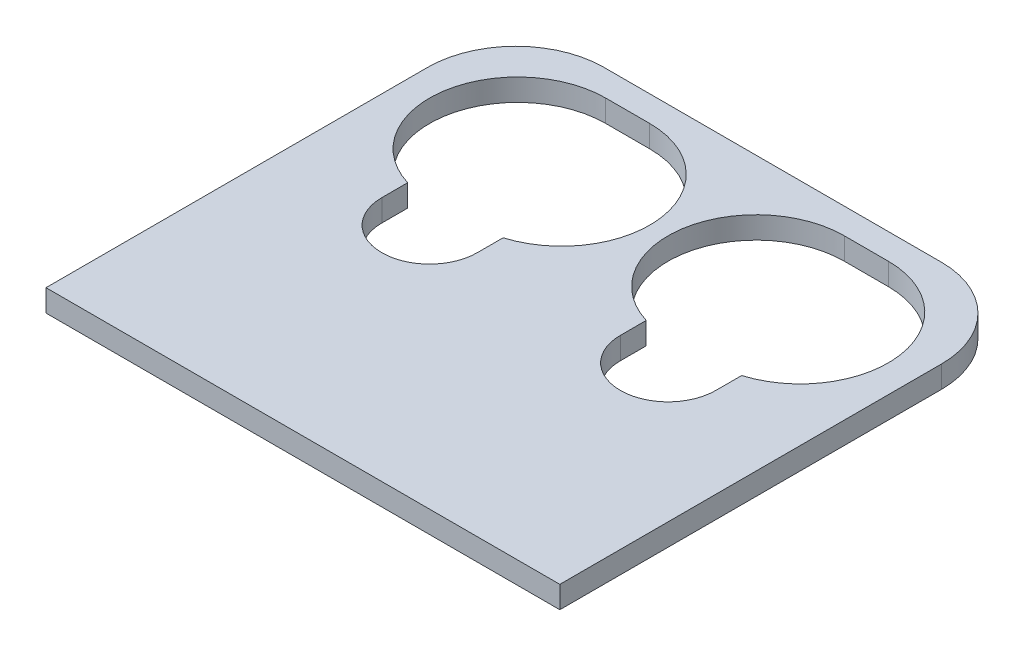
ISO-10303-21;
HEADER;
FILE_DESCRIPTION(('STEP AP214'),'2;1');
FILE_NAME('part.step','',(''),(''),'','','');
FILE_SCHEMA(('AUTOMOTIVE_DESIGN { 1 0 10303 214 1 1 1 1 }'));
ENDSEC;
DATA;
#1=APPLICATION_CONTEXT('core data for automotive mechanical design processes');
#2=APPLICATION_PROTOCOL_DEFINITION('international standard','automotive_design',2000,#1);
#3=PRODUCT_CONTEXT('',#1,'mechanical');
#4=PRODUCT('Part','Part','',(#3));
#5=PRODUCT_RELATED_PRODUCT_CATEGORY('part','',(#4));
#6=PRODUCT_DEFINITION_FORMATION('','',#4);
#7=PRODUCT_DEFINITION_CONTEXT('part definition',#1,'design');
#8=PRODUCT_DEFINITION('design','',#6,#7);
#9=PRODUCT_DEFINITION_SHAPE('','',#8);
#10=(LENGTH_UNIT() NAMED_UNIT(*) SI_UNIT(.MILLI.,.METRE.));
#11=(NAMED_UNIT(*) PLANE_ANGLE_UNIT() SI_UNIT($,.RADIAN.));
#12=(NAMED_UNIT(*) SI_UNIT($,.STERADIAN.) SOLID_ANGLE_UNIT());
#13=UNCERTAINTY_MEASURE_WITH_UNIT(LENGTH_MEASURE(1.E-05),#10,'distance_accuracy_value','');
#14=(GEOMETRIC_REPRESENTATION_CONTEXT(3) GLOBAL_UNCERTAINTY_ASSIGNED_CONTEXT((#13)) GLOBAL_UNIT_ASSIGNED_CONTEXT((#10,
#11,#12)) REPRESENTATION_CONTEXT('',''));
#15=CARTESIAN_POINT('',(0.,0.,0.));
#16=DIRECTION('',(0.,0.,1.));
#17=DIRECTION('',(1.,0.,0.));
#18=AXIS2_PLACEMENT_3D('',#15,#16,#17);
#19=CARTESIAN_POINT('',(0.,3.,0.));
#20=DIRECTION('',(0.,-1.,0.));
#21=DIRECTION('',(0.,0.,-1.));
#22=AXIS2_PLACEMENT_3D('',#19,#20,#21);
#23=PLANE('',#22);
#24=DIRECTION('',(0.,0.,-1.));
#25=VECTOR('',#24,1.);
#26=CARTESIAN_POINT('',(35.,3.,33.5));
#27=LINE('',#26,#25);
#28=CARTESIAN_POINT('',(35.,3.,33.5));
#29=VERTEX_POINT('',#28);
#30=CARTESIAN_POINT('',(35.,3.,-18.5));
#31=VERTEX_POINT('',#30);
#32=EDGE_CURVE('E281',#29,#31,#27,.T.);
#33=ORIENTED_EDGE('',*,*,#32,.T.);
#34=CARTESIAN_POINT('',(23.,3.,-18.5));
#35=DIRECTION('',(0.,-1.,0.));
#36=DIRECTION('',(0.,0.,-1.));
#37=AXIS2_PLACEMENT_3D('',#34,#35,#36);
#38=CIRCLE('',#37,12.);
#39=CARTESIAN_POINT('',(23.,3.,-30.5));
#40=VERTEX_POINT('',#39);
#41=EDGE_CURVE('E305',#31,#40,#38,.F.);
#42=ORIENTED_EDGE('',*,*,#41,.T.);
#43=DIRECTION('',(-1.,0.,0.));
#44=VECTOR('',#43,1.);
#45=CARTESIAN_POINT('',(0.,3.,-30.5));
#46=LINE('',#45,#44);
#47=CARTESIAN_POINT('',(-23.,3.,-30.5));
#48=VERTEX_POINT('',#47);
#49=EDGE_CURVE('E277',#40,#48,#46,.T.);
#50=ORIENTED_EDGE('',*,*,#49,.T.);
#51=CARTESIAN_POINT('',(-23.,3.,-18.5));
#52=DIRECTION('',(0.,-1.,0.));
#53=DIRECTION('',(0.,0.,-1.));
#54=AXIS2_PLACEMENT_3D('',#51,#52,#53);
#55=CIRCLE('',#54,12.);
#56=CARTESIAN_POINT('',(-35.,3.,-18.5));
#57=VERTEX_POINT('',#56);
#58=EDGE_CURVE('E303',#48,#57,#55,.F.);
#59=ORIENTED_EDGE('',*,*,#58,.T.);
#60=DIRECTION('',(0.,0.,1.));
#61=VECTOR('',#60,1.);
#62=CARTESIAN_POINT('',(-35.,3.,33.5));
#63=LINE('',#62,#61);
#64=CARTESIAN_POINT('',(-35.,3.,33.5));
#65=VERTEX_POINT('',#64);
#66=EDGE_CURVE('E284',#57,#65,#63,.T.);
#67=ORIENTED_EDGE('',*,*,#66,.T.);
#68=DIRECTION('',(1.,0.,0.));
#69=VECTOR('',#68,1.);
#70=CARTESIAN_POINT('',(-35.,3.,33.5));
#71=LINE('',#70,#69);
#72=EDGE_CURVE('E287',#65,#29,#71,.T.);
#73=ORIENTED_EDGE('',*,*,#72,.T.);
#74=EDGE_LOOP('',(#33,#42,#50,#59,#67,#73));
#75=FACE_BOUND('',#74,.T.);
#76=CARTESIAN_POINT('',(-16.25,3.,0.));
#77=DIRECTION('',(0.,-1.,0.));
#78=DIRECTION('',(0.,0.,-1.));
#79=AXIS2_PLACEMENT_3D('',#76,#77,#78);
#80=CIRCLE('',#79,6.5);
#81=CARTESIAN_POINT('',(-9.75,3.,0.));
#82=VERTEX_POINT('',#81);
#83=CARTESIAN_POINT('',(-22.75,3.,0.));
#84=VERTEX_POINT('',#83);
#85=EDGE_CURVE('E270',#82,#84,#80,.T.);
#86=ORIENTED_EDGE('',*,*,#85,.T.);
#87=DIRECTION('',(0.,0.,-1.));
#88=VECTOR('',#87,1.);
#89=CARTESIAN_POINT('',(-22.75,3.,0.));
#90=LINE('',#89,#88);
#91=CARTESIAN_POINT('',(-22.75,3.,-3.521759716751));
#92=VERTEX_POINT('',#91);
#93=EDGE_CURVE('E242',#84,#92,#90,.T.);
#94=ORIENTED_EDGE('',*,*,#93,.T.);
#95=CARTESIAN_POINT('',(-19.25,3.,-15.));
#96=DIRECTION('',(0.,-1.,0.));
#97=DIRECTION('',(0.,0.,-1.));
#98=AXIS2_PLACEMENT_3D('',#95,#96,#97);
#99=CIRCLE('',#98,12.);
#100=CARTESIAN_POINT('',(-19.25,3.000006,-27.));
#101=VERTEX_POINT('',#100);
#102=EDGE_CURVE('E323',#92,#101,#99,.T.);
#103=ORIENTED_EDGE('',*,*,#102,.T.);
#104=DIRECTION('',(1.,0.,0.));
#105=VECTOR('',#104,1.);
#106=CARTESIAN_POINT('',(0.,3.,-27.));
#107=LINE('',#106,#105);
#108=CARTESIAN_POINT('',(-13.25,3.000006,-27.));
#109=VERTEX_POINT('',#108);
#110=EDGE_CURVE('E271',#101,#109,#107,.T.);
#111=ORIENTED_EDGE('',*,*,#110,.T.);
#112=CARTESIAN_POINT('',(-13.25,3.,-15.));
#113=DIRECTION('',(0.,-1.,0.));
#114=DIRECTION('',(0.,0.,-1.));
#115=AXIS2_PLACEMENT_3D('',#112,#113,#114);
#116=CIRCLE('',#115,12.);
#117=CARTESIAN_POINT('',(-9.75,3.,-3.521759716751));
#118=VERTEX_POINT('',#117);
#119=EDGE_CURVE('E263',#109,#118,#116,.T.);
#120=ORIENTED_EDGE('',*,*,#119,.T.);
#121=DIRECTION('',(0.,0.,1.));
#122=VECTOR('',#121,1.);
#123=CARTESIAN_POINT('',(-9.75,3.,0.));
#124=LINE('',#123,#122);
#125=EDGE_CURVE('E237',#118,#82,#124,.T.);
#126=ORIENTED_EDGE('',*,*,#125,.T.);
#127=EDGE_LOOP('',(#86,#94,#103,#111,#120,#126));
#128=FACE_BOUND('',#127,.T.);
#129=DIRECTION('',(0.,0.,-1.));
#130=VECTOR('',#129,1.);
#131=CARTESIAN_POINT('',(22.75,3.,0.));
#132=LINE('',#131,#130);
#133=CARTESIAN_POINT('',(22.75,3.,0.));
#134=VERTEX_POINT('',#133);
#135=CARTESIAN_POINT('',(22.75,3.,-3.521759716751));
#136=VERTEX_POINT('',#135);
#137=EDGE_CURVE('E48',#134,#136,#132,.T.);
#138=ORIENTED_EDGE('',*,*,#137,.F.);
#139=CARTESIAN_POINT('',(16.25,3.,0.));
#140=DIRECTION('',(0.,-1.,0.));
#141=DIRECTION('',(0.,0.,-1.));
#142=AXIS2_PLACEMENT_3D('',#139,#140,#141);
#143=CIRCLE('',#142,6.5);
#144=CARTESIAN_POINT('',(9.75,3.,0.));
#145=VERTEX_POINT('',#144);
#146=EDGE_CURVE('E177',#145,#134,#143,.F.);
#147=ORIENTED_EDGE('',*,*,#146,.F.);
#148=DIRECTION('',(0.,0.,1.));
#149=VECTOR('',#148,1.);
#150=CARTESIAN_POINT('',(9.75,3.,0.));
#151=LINE('',#150,#149);
#152=CARTESIAN_POINT('',(9.75,3.,-3.521759716751));
#153=VERTEX_POINT('',#152);
#154=EDGE_CURVE('E158',#153,#145,#151,.T.);
#155=ORIENTED_EDGE('',*,*,#154,.F.);
#156=CARTESIAN_POINT('',(13.25,3.,-15.));
#157=DIRECTION('',(0.,-1.,0.));
#158=DIRECTION('',(0.,0.,-1.));
#159=AXIS2_PLACEMENT_3D('',#156,#157,#158);
#160=CIRCLE('',#159,12.);
#161=CARTESIAN_POINT('',(13.25,3.,-27.));
#162=VERTEX_POINT('',#161);
#163=EDGE_CURVE('E197',#162,#153,#160,.F.);
#164=ORIENTED_EDGE('',*,*,#163,.F.);
#165=DIRECTION('',(-1.,0.,0.));
#166=VECTOR('',#165,1.);
#167=CARTESIAN_POINT('',(0.,3.,-27.));
#168=LINE('',#167,#166);
#169=CARTESIAN_POINT('',(19.25,3.,-27.));
#170=VERTEX_POINT('',#169);
#171=EDGE_CURVE('E178',#170,#162,#168,.T.);
#172=ORIENTED_EDGE('',*,*,#171,.F.);
#173=CARTESIAN_POINT('',(19.25,3.,-15.));
#174=DIRECTION('',(0.,-1.,0.));
#175=DIRECTION('',(0.,0.,-1.));
#176=AXIS2_PLACEMENT_3D('',#173,#174,#175);
#177=CIRCLE('',#176,12.);
#178=EDGE_CURVE('E182',#136,#170,#177,.F.);
#179=ORIENTED_EDGE('',*,*,#178,.F.);
#180=EDGE_LOOP('',(#138,#147,#155,#164,#172,#179));
#181=FACE_BOUND('',#180,.T.);
#182=ADVANCED_FACE('F33',(#75,#128,#181),#23,.F.);
#183=CARTESIAN_POINT('',(0.,0.,0.));
#184=DIRECTION('',(0.,-1.,0.));
#185=DIRECTION('',(0.,0.,-1.));
#186=AXIS2_PLACEMENT_3D('',#183,#184,#185);
#187=PLANE('',#186);
#188=DIRECTION('',(0.,0.,-1.));
#189=VECTOR('',#188,1.);
#190=CARTESIAN_POINT('',(-22.75,0.,0.));
#191=LINE('',#190,#189);
#192=CARTESIAN_POINT('',(-22.75,0.,0.));
#193=VERTEX_POINT('',#192);
#194=CARTESIAN_POINT('',(-22.75,0.,-3.521759716751));
#195=VERTEX_POINT('',#194);
#196=EDGE_CURVE('E240',#193,#195,#191,.T.);
#197=ORIENTED_EDGE('',*,*,#196,.F.);
#198=CARTESIAN_POINT('',(-16.25,0.,0.));
#199=DIRECTION('',(0.,1.,0.));
#200=DIRECTION('',(0.,0.,1.));
#201=AXIS2_PLACEMENT_3D('',#198,#199,#200);
#202=CIRCLE('',#201,6.5);
#203=CARTESIAN_POINT('',(-9.75,0.,0.));
#204=VERTEX_POINT('',#203);
#205=EDGE_CURVE('E267',#193,#204,#202,.T.);
#206=ORIENTED_EDGE('',*,*,#205,.T.);
#207=DIRECTION('',(0.,0.,1.));
#208=VECTOR('',#207,1.);
#209=CARTESIAN_POINT('',(-9.75,0.,0.));
#210=LINE('',#209,#208);
#211=CARTESIAN_POINT('',(-9.75,0.,-3.521759716751));
#212=VERTEX_POINT('',#211);
#213=EDGE_CURVE('E233',#212,#204,#210,.T.);
#214=ORIENTED_EDGE('',*,*,#213,.F.);
#215=CARTESIAN_POINT('',(-13.25,0.,-15.));
#216=DIRECTION('',(0.,1.,0.));
#217=DIRECTION('',(0.,0.,1.));
#218=AXIS2_PLACEMENT_3D('',#215,#216,#217);
#219=CIRCLE('',#218,12.);
#220=CARTESIAN_POINT('',(-13.25,0.,-27.));
#221=VERTEX_POINT('',#220);
#222=EDGE_CURVE('E248',#212,#221,#219,.T.);
#223=ORIENTED_EDGE('',*,*,#222,.T.);
#224=DIRECTION('',(-1.,0.,0.));
#225=VECTOR('',#224,1.);
#226=CARTESIAN_POINT('',(-19.25,0.,-27.));
#227=LINE('',#226,#225);
#228=CARTESIAN_POINT('',(-19.25,0.,-27.));
#229=VERTEX_POINT('',#228);
#230=EDGE_CURVE('E250',#221,#229,#227,.T.);
#231=ORIENTED_EDGE('',*,*,#230,.T.);
#232=CARTESIAN_POINT('',(-19.25,0.,-15.));
#233=DIRECTION('',(0.,1.,0.));
#234=DIRECTION('',(0.,0.,1.));
#235=AXIS2_PLACEMENT_3D('',#232,#233,#234);
#236=CIRCLE('',#235,12.);
#237=EDGE_CURVE('E245',#229,#195,#236,.T.);
#238=ORIENTED_EDGE('',*,*,#237,.T.);
#239=EDGE_LOOP('',(#197,#206,#214,#223,#231,#238));
#240=FACE_BOUND('',#239,.T.);
#241=DIRECTION('',(1.,0.,0.));
#242=VECTOR('',#241,1.);
#243=CARTESIAN_POINT('',(-35.,0.,-30.5));
#244=LINE('',#243,#242);
#245=CARTESIAN_POINT('',(-23.,0.,-30.5));
#246=VERTEX_POINT('',#245);
#247=CARTESIAN_POINT('',(23.,0.,-30.5));
#248=VERTEX_POINT('',#247);
#249=EDGE_CURVE('E274',#246,#248,#244,.T.);
#250=ORIENTED_EDGE('',*,*,#249,.T.);
#251=CARTESIAN_POINT('',(23.,0.,-18.5));
#252=DIRECTION('',(0.,-1.,0.));
#253=DIRECTION('',(0.,0.,-1.));
#254=AXIS2_PLACEMENT_3D('',#251,#252,#253);
#255=CIRCLE('',#254,12.);
#256=CARTESIAN_POINT('',(35.,0.,-18.5));
#257=VERTEX_POINT('',#256);
#258=EDGE_CURVE('E314',#248,#257,#255,.T.);
#259=ORIENTED_EDGE('',*,*,#258,.T.);
#260=DIRECTION('',(0.,0.,-1.));
#261=VECTOR('',#260,1.);
#262=CARTESIAN_POINT('',(35.,0.,33.5));
#263=LINE('',#262,#261);
#264=CARTESIAN_POINT('',(35.,0.,33.5));
#265=VERTEX_POINT('',#264);
#266=EDGE_CURVE('E280',#265,#257,#263,.T.);
#267=ORIENTED_EDGE('',*,*,#266,.F.);
#268=DIRECTION('',(1.,0.,0.));
#269=VECTOR('',#268,1.);
#270=CARTESIAN_POINT('',(-35.,0.,33.5));
#271=LINE('',#270,#269);
#272=CARTESIAN_POINT('',(-35.,0.,33.5));
#273=VERTEX_POINT('',#272);
#274=EDGE_CURVE('E285',#273,#265,#271,.T.);
#275=ORIENTED_EDGE('',*,*,#274,.F.);
#276=DIRECTION('',(0.,0.,1.));
#277=VECTOR('',#276,1.);
#278=CARTESIAN_POINT('',(-35.,0.,33.5));
#279=LINE('',#278,#277);
#280=CARTESIAN_POINT('',(-35.,0.,-18.5));
#281=VERTEX_POINT('',#280);
#282=EDGE_CURVE('E292',#281,#273,#279,.T.);
#283=ORIENTED_EDGE('',*,*,#282,.F.);
#284=CARTESIAN_POINT('',(-23.,0.,-18.5));
#285=DIRECTION('',(0.,-1.,0.));
#286=DIRECTION('',(0.,0.,-1.));
#287=AXIS2_PLACEMENT_3D('',#284,#285,#286);
#288=CIRCLE('',#287,12.);
#289=EDGE_CURVE('E312',#281,#246,#288,.T.);
#290=ORIENTED_EDGE('',*,*,#289,.T.);
#291=EDGE_LOOP('',(#250,#259,#267,#275,#283,#290));
#292=FACE_BOUND('',#291,.T.);
#293=CARTESIAN_POINT('',(16.25,0.,0.));
#294=DIRECTION('',(0.,-1.,0.));
#295=DIRECTION('',(0.,0.,-1.));
#296=AXIS2_PLACEMENT_3D('',#293,#294,#295);
#297=CIRCLE('',#296,6.5);
#298=CARTESIAN_POINT('',(9.75,0.,0.));
#299=VERTEX_POINT('',#298);
#300=CARTESIAN_POINT('',(22.75,0.,0.));
#301=VERTEX_POINT('',#300);
#302=EDGE_CURVE('E170',#299,#301,#297,.F.);
#303=ORIENTED_EDGE('',*,*,#302,.T.);
#304=DIRECTION('',(0.,0.,-1.));
#305=VECTOR('',#304,1.);
#306=CARTESIAN_POINT('',(22.75,0.,0.));
#307=LINE('',#306,#305);
#308=CARTESIAN_POINT('',(22.75,0.,-3.521759716751));
#309=VERTEX_POINT('',#308);
#310=EDGE_CURVE('E217',#301,#309,#307,.T.);
#311=ORIENTED_EDGE('',*,*,#310,.T.);
#312=CARTESIAN_POINT('',(19.25,0.,-15.));
#313=DIRECTION('',(0.,-1.,0.));
#314=DIRECTION('',(0.,0.,-1.));
#315=AXIS2_PLACEMENT_3D('',#312,#313,#314);
#316=CIRCLE('',#315,12.);
#317=CARTESIAN_POINT('',(19.25,-2.5E-06,-27.));
#318=VERTEX_POINT('',#317);
#319=EDGE_CURVE('E196',#309,#318,#316,.F.);
#320=ORIENTED_EDGE('',*,*,#319,.T.);
#321=DIRECTION('',(-1.,0.,0.));
#322=VECTOR('',#321,1.);
#323=CARTESIAN_POINT('',(0.,0.,-27.));
#324=LINE('',#323,#322);
#325=CARTESIAN_POINT('',(13.25,-2.5E-06,-27.));
#326=VERTEX_POINT('',#325);
#327=EDGE_CURVE('E193',#318,#326,#324,.T.);
#328=ORIENTED_EDGE('',*,*,#327,.T.);
#329=CARTESIAN_POINT('',(13.25,0.,-15.));
#330=DIRECTION('',(0.,-1.,0.));
#331=DIRECTION('',(0.,0.,-1.));
#332=AXIS2_PLACEMENT_3D('',#329,#330,#331);
#333=CIRCLE('',#332,12.);
#334=CARTESIAN_POINT('',(9.75,0.,-3.521759716751));
#335=VERTEX_POINT('',#334);
#336=EDGE_CURVE('E173',#326,#335,#333,.F.);
#337=ORIENTED_EDGE('',*,*,#336,.T.);
#338=DIRECTION('',(0.,0.,1.));
#339=VECTOR('',#338,1.);
#340=CARTESIAN_POINT('',(9.75,0.,0.));
#341=LINE('',#340,#339);
#342=EDGE_CURVE('E55',#335,#299,#341,.T.);
#343=ORIENTED_EDGE('',*,*,#342,.T.);
#344=EDGE_LOOP('',(#303,#311,#320,#328,#337,#343));
#345=FACE_BOUND('',#344,.T.);
#346=ADVANCED_FACE('F168',(#240,#292,#345),#187,.T.);
#347=CARTESIAN_POINT('',(16.25,-2.49999999998515E-05,0.));
#348=DIRECTION('',(0.,1.,0.));
#349=DIRECTION('',(0.,0.,1.));
#350=AXIS2_PLACEMENT_3D('',#347,#348,#349);
#351=CYLINDRICAL_SURFACE('',#350,6.5);
#352=ORIENTED_EDGE('',*,*,#146,.T.);
#353=DIRECTION('',(0.,1.,0.));
#354=VECTOR('',#353,1.);
#355=CARTESIAN_POINT('',(22.75,-0.000139999999999169,0.));
#356=LINE('',#355,#354);
#357=EDGE_CURVE('E163',#301,#134,#356,.T.);
#358=ORIENTED_EDGE('',*,*,#357,.F.);
#359=ORIENTED_EDGE('',*,*,#302,.F.);
#360=DIRECTION('',(0.,1.,0.));
#361=VECTOR('',#360,1.);
#362=CARTESIAN_POINT('',(9.75,-0.000139999999999169,0.));
#363=LINE('',#362,#361);
#364=EDGE_CURVE('E155',#299,#145,#363,.T.);
#365=ORIENTED_EDGE('',*,*,#364,.T.);
#366=EDGE_LOOP('',(#352,#358,#359,#365));
#367=FACE_BOUND('',#366,.T.);
#368=ADVANCED_FACE('F176',(#367),#351,.F.);
#369=CARTESIAN_POINT('',(19.25,-2.49999999998515E-05,-15.));
#370=DIRECTION('',(0.,1.,0.));
#371=DIRECTION('',(0.,0.,1.));
#372=AXIS2_PLACEMENT_3D('',#369,#370,#371);
#373=CYLINDRICAL_SURFACE('',#372,12.);
#374=ORIENTED_EDGE('',*,*,#319,.F.);
#375=DIRECTION('',(0.,1.,0.));
#376=VECTOR('',#375,1.);
#377=CARTESIAN_POINT('',(22.75,-2.49999999998515E-05,-3.521759716751));
#378=LINE('',#377,#376);
#379=EDGE_CURVE('E11',#309,#136,#378,.T.);
#380=ORIENTED_EDGE('',*,*,#379,.T.);
#381=ORIENTED_EDGE('',*,*,#178,.T.);
#382=DIRECTION('',(0.,1.,0.));
#383=VECTOR('',#382,1.);
#384=CARTESIAN_POINT('',(19.25,-2.49999999998515E-05,-27.));
#385=LINE('',#384,#383);
#386=EDGE_CURVE('E212',#318,#170,#385,.T.);
#387=ORIENTED_EDGE('',*,*,#386,.F.);
#388=EDGE_LOOP('',(#374,#380,#381,#387));
#389=FACE_BOUND('',#388,.T.);
#390=ADVANCED_FACE('F226',(#389),#373,.F.);
#391=CARTESIAN_POINT('',(13.25,-2.49999999998515E-05,-15.));
#392=DIRECTION('',(0.,1.,0.));
#393=DIRECTION('',(0.,0.,1.));
#394=AXIS2_PLACEMENT_3D('',#391,#392,#393);
#395=CYLINDRICAL_SURFACE('',#394,12.);
#396=ORIENTED_EDGE('',*,*,#163,.T.);
#397=DIRECTION('',(0.,1.,0.));
#398=VECTOR('',#397,1.);
#399=CARTESIAN_POINT('',(9.75,-2.49999999998515E-05,-3.521759716751));
#400=LINE('',#399,#398);
#401=EDGE_CURVE('E41',#153,#335,#400,.F.);
#402=ORIENTED_EDGE('',*,*,#401,.T.);
#403=ORIENTED_EDGE('',*,*,#336,.F.);
#404=DIRECTION('',(0.,1.,0.));
#405=VECTOR('',#404,1.);
#406=CARTESIAN_POINT('',(13.25,-2.49999999998515E-05,-27.));
#407=LINE('',#406,#405);
#408=EDGE_CURVE('E206',#326,#162,#407,.T.);
#409=ORIENTED_EDGE('',*,*,#408,.T.);
#410=EDGE_LOOP('',(#396,#402,#403,#409));
#411=FACE_BOUND('',#410,.T.);
#412=ADVANCED_FACE('F385',(#411),#395,.F.);
#413=CARTESIAN_POINT('',(35.,3.,33.5));
#414=DIRECTION('',(-1.,0.,0.));
#415=DIRECTION('',(0.,0.,1.));
#416=AXIS2_PLACEMENT_3D('',#413,#414,#415);
#417=PLANE('',#416);
#418=ORIENTED_EDGE('',*,*,#266,.T.);
#419=DIRECTION('',(0.,1.,0.));
#420=VECTOR('',#419,1.);
#421=CARTESIAN_POINT('',(35.,3.,-18.5));
#422=LINE('',#421,#420);
#423=EDGE_CURVE('E300',#257,#31,#422,.T.);
#424=ORIENTED_EDGE('',*,*,#423,.T.);
#425=ORIENTED_EDGE('',*,*,#32,.F.);
#426=DIRECTION('',(0.,-1.,0.));
#427=VECTOR('',#426,1.);
#428=CARTESIAN_POINT('',(35.,3.,33.5));
#429=LINE('',#428,#427);
#430=EDGE_CURVE('E289',#29,#265,#429,.T.);
#431=ORIENTED_EDGE('',*,*,#430,.T.);
#432=EDGE_LOOP('',(#418,#424,#425,#431));
#433=FACE_BOUND('',#432,.T.);
#434=ADVANCED_FACE('F382',(#433),#417,.F.);
#435=CARTESIAN_POINT('',(-35.,3.,33.5));
#436=DIRECTION('',(1.,0.,0.));
#437=DIRECTION('',(0.,0.,-1.));
#438=AXIS2_PLACEMENT_3D('',#435,#436,#437);
#439=PLANE('',#438);
#440=ORIENTED_EDGE('',*,*,#66,.F.);
#441=DIRECTION('',(0.,1.,0.));
#442=VECTOR('',#441,1.);
#443=CARTESIAN_POINT('',(-35.,3.,-18.5));
#444=LINE('',#443,#442);
#445=EDGE_CURVE('E316',#57,#281,#444,.F.);
#446=ORIENTED_EDGE('',*,*,#445,.T.);
#447=ORIENTED_EDGE('',*,*,#282,.T.);
#448=DIRECTION('',(0.,-1.,0.));
#449=VECTOR('',#448,1.);
#450=CARTESIAN_POINT('',(-35.,3.,33.5));
#451=LINE('',#450,#449);
#452=EDGE_CURVE('E297',#65,#273,#451,.T.);
#453=ORIENTED_EDGE('',*,*,#452,.F.);
#454=EDGE_LOOP('',(#440,#446,#447,#453));
#455=FACE_BOUND('',#454,.T.);
#456=ADVANCED_FACE('F378',(#455),#439,.F.);
#457=CARTESIAN_POINT('',(-35.,3.,33.5));
#458=DIRECTION('',(0.,0.,-1.));
#459=DIRECTION('',(-1.,0.,0.));
#460=AXIS2_PLACEMENT_3D('',#457,#458,#459);
#461=PLANE('',#460);
#462=ORIENTED_EDGE('',*,*,#274,.T.);
#463=ORIENTED_EDGE('',*,*,#430,.F.);
#464=ORIENTED_EDGE('',*,*,#72,.F.);
#465=ORIENTED_EDGE('',*,*,#452,.T.);
#466=EDGE_LOOP('',(#462,#463,#464,#465));
#467=FACE_BOUND('',#466,.T.);
#468=ADVANCED_FACE('F375',(#467),#461,.F.);
#469=CARTESIAN_POINT('',(-35.,0.,-30.5));
#470=DIRECTION('',(0.,0.,1.));
#471=DIRECTION('',(1.,0.,0.));
#472=AXIS2_PLACEMENT_3D('',#469,#470,#471);
#473=PLANE('',#472);
#474=ORIENTED_EDGE('',*,*,#49,.F.);
#475=DIRECTION('',(0.,1.,0.));
#476=VECTOR('',#475,1.);
#477=CARTESIAN_POINT('',(23.,0.,-30.5));
#478=LINE('',#477,#476);
#479=EDGE_CURVE('E310',#40,#248,#478,.F.);
#480=ORIENTED_EDGE('',*,*,#479,.T.);
#481=ORIENTED_EDGE('',*,*,#249,.F.);
#482=DIRECTION('',(0.,1.,0.));
#483=VECTOR('',#482,1.);
#484=CARTESIAN_POINT('',(-23.,0.,-30.5));
#485=LINE('',#484,#483);
#486=EDGE_CURVE('E307',#246,#48,#485,.T.);
#487=ORIENTED_EDGE('',*,*,#486,.T.);
#488=EDGE_LOOP('',(#474,#480,#481,#487));
#489=FACE_BOUND('',#488,.T.);
#490=ADVANCED_FACE('F372',(#489),#473,.F.);
#491=CARTESIAN_POINT('',(23.,3.,-18.5));
#492=DIRECTION('',(0.,1.,0.));
#493=DIRECTION('',(0.,0.,1.));
#494=AXIS2_PLACEMENT_3D('',#491,#492,#493);
#495=CYLINDRICAL_SURFACE('',#494,12.);
#496=ORIENTED_EDGE('',*,*,#258,.F.);
#497=ORIENTED_EDGE('',*,*,#479,.F.);
#498=ORIENTED_EDGE('',*,*,#41,.F.);
#499=ORIENTED_EDGE('',*,*,#423,.F.);
#500=EDGE_LOOP('',(#496,#497,#498,#499));
#501=FACE_BOUND('',#500,.T.);
#502=ADVANCED_FACE('F387',(#501),#495,.T.);
#503=CARTESIAN_POINT('',(-23.,0.,-18.5));
#504=DIRECTION('',(0.,1.,0.));
#505=DIRECTION('',(0.,0.,1.));
#506=AXIS2_PLACEMENT_3D('',#503,#504,#505);
#507=CYLINDRICAL_SURFACE('',#506,12.);
#508=ORIENTED_EDGE('',*,*,#289,.F.);
#509=ORIENTED_EDGE('',*,*,#445,.F.);
#510=ORIENTED_EDGE('',*,*,#58,.F.);
#511=ORIENTED_EDGE('',*,*,#486,.F.);
#512=EDGE_LOOP('',(#508,#509,#510,#511));
#513=FACE_BOUND('',#512,.T.);
#514=ADVANCED_FACE('F35',(#513),#507,.T.);
#515=CARTESIAN_POINT('',(-16.25,0.,0.));
#516=DIRECTION('',(0.,1.,0.));
#517=DIRECTION('',(0.,0.,1.));
#518=AXIS2_PLACEMENT_3D('',#515,#516,#517);
#519=CYLINDRICAL_SURFACE('',#518,6.5);
#520=ORIENTED_EDGE('',*,*,#85,.F.);
#521=DIRECTION('',(0.,1.,0.));
#522=VECTOR('',#521,1.);
#523=CARTESIAN_POINT('',(-9.75,-2.49999999998515E-05,0.));
#524=LINE('',#523,#522);
#525=EDGE_CURVE('E231',#204,#82,#524,.T.);
#526=ORIENTED_EDGE('',*,*,#525,.F.);
#527=ORIENTED_EDGE('',*,*,#205,.F.);
#528=DIRECTION('',(0.,1.,0.));
#529=VECTOR('',#528,1.);
#530=CARTESIAN_POINT('',(-22.75,-2.49999999998515E-05,0.));
#531=LINE('',#530,#529);
#532=EDGE_CURVE('E180',#193,#84,#531,.T.);
#533=ORIENTED_EDGE('',*,*,#532,.T.);
#534=EDGE_LOOP('',(#520,#526,#527,#533));
#535=FACE_BOUND('',#534,.T.);
#536=ADVANCED_FACE('F352',(#535),#519,.F.);
#537=CARTESIAN_POINT('',(-19.25,0.,-27.));
#538=DIRECTION('',(0.,0.,-1.));
#539=DIRECTION('',(-1.,0.,0.));
#540=AXIS2_PLACEMENT_3D('',#537,#538,#539);
#541=PLANE('',#540);
#542=DIRECTION('',(0.,1.,0.));
#543=VECTOR('',#542,1.);
#544=CARTESIAN_POINT('',(-19.25,0.,-27.));
#545=LINE('',#544,#543);
#546=EDGE_CURVE('E262',#229,#101,#545,.T.);
#547=ORIENTED_EDGE('',*,*,#546,.F.);
#548=ORIENTED_EDGE('',*,*,#230,.F.);
#549=DIRECTION('',(0.,1.,0.));
#550=VECTOR('',#549,1.);
#551=CARTESIAN_POINT('',(-13.25,0.,-27.));
#552=LINE('',#551,#550);
#553=EDGE_CURVE('E253',#221,#109,#552,.T.);
#554=ORIENTED_EDGE('',*,*,#553,.T.);
#555=ORIENTED_EDGE('',*,*,#110,.F.);
#556=EDGE_LOOP('',(#547,#548,#554,#555));
#557=FACE_BOUND('',#556,.T.);
#558=ADVANCED_FACE('F346',(#557),#541,.F.);
#559=CARTESIAN_POINT('',(-19.25,0.,-15.));
#560=DIRECTION('',(0.,1.,0.));
#561=DIRECTION('',(0.,0.,1.));
#562=AXIS2_PLACEMENT_3D('',#559,#560,#561);
#563=CYLINDRICAL_SURFACE('',#562,12.);
#564=ORIENTED_EDGE('',*,*,#102,.F.);
#565=DIRECTION('',(0.,1.,0.));
#566=VECTOR('',#565,1.);
#567=CARTESIAN_POINT('',(-22.75,0.,-3.521759716751));
#568=LINE('',#567,#566);
#569=EDGE_CURVE('E186',#92,#195,#568,.F.);
#570=ORIENTED_EDGE('',*,*,#569,.T.);
#571=ORIENTED_EDGE('',*,*,#237,.F.);
#572=ORIENTED_EDGE('',*,*,#546,.T.);
#573=EDGE_LOOP('',(#564,#570,#571,#572));
#574=FACE_BOUND('',#573,.T.);
#575=ADVANCED_FACE('F336',(#574),#563,.F.);
#576=CARTESIAN_POINT('',(-13.25,0.,-15.));
#577=DIRECTION('',(0.,1.,0.));
#578=DIRECTION('',(0.,0.,1.));
#579=AXIS2_PLACEMENT_3D('',#576,#577,#578);
#580=CYLINDRICAL_SURFACE('',#579,12.);
#581=ORIENTED_EDGE('',*,*,#222,.F.);
#582=DIRECTION('',(0.,1.,0.));
#583=VECTOR('',#582,1.);
#584=CARTESIAN_POINT('',(-9.75,0.,-3.521759716751));
#585=LINE('',#584,#583);
#586=EDGE_CURVE('E318',#212,#118,#585,.T.);
#587=ORIENTED_EDGE('',*,*,#586,.T.);
#588=ORIENTED_EDGE('',*,*,#119,.F.);
#589=ORIENTED_EDGE('',*,*,#553,.F.);
#590=EDGE_LOOP('',(#581,#587,#588,#589));
#591=FACE_BOUND('',#590,.T.);
#592=ADVANCED_FACE('F347',(#591),#580,.F.);
#593=CARTESIAN_POINT('',(-9.75,-2.49999999998515E-05,0.));
#594=DIRECTION('',(1.,0.,0.));
#595=DIRECTION('',(0.,0.,-1.));
#596=AXIS2_PLACEMENT_3D('',#593,#594,#595);
#597=PLANE('',#596);
#598=ORIENTED_EDGE('',*,*,#586,.F.);
#599=ORIENTED_EDGE('',*,*,#213,.T.);
#600=ORIENTED_EDGE('',*,*,#525,.T.);
#601=ORIENTED_EDGE('',*,*,#125,.F.);
#602=EDGE_LOOP('',(#598,#599,#600,#601));
#603=FACE_BOUND('',#602,.T.);
#604=ADVANCED_FACE('F355',(#603),#597,.F.);
#605=CARTESIAN_POINT('',(-22.75,-2.49999999998515E-05,0.));
#606=DIRECTION('',(-1.,0.,0.));
#607=DIRECTION('',(0.,0.,1.));
#608=AXIS2_PLACEMENT_3D('',#605,#606,#607);
#609=PLANE('',#608);
#610=ORIENTED_EDGE('',*,*,#532,.F.);
#611=ORIENTED_EDGE('',*,*,#196,.T.);
#612=ORIENTED_EDGE('',*,*,#569,.F.);
#613=ORIENTED_EDGE('',*,*,#93,.F.);
#614=EDGE_LOOP('',(#610,#611,#612,#613));
#615=FACE_BOUND('',#614,.T.);
#616=ADVANCED_FACE('F353',(#615),#609,.F.);
#617=CARTESIAN_POINT('',(19.25,-2.49999999998515E-05,-27.));
#618=DIRECTION('',(0.,0.,1.));
#619=DIRECTION('',(1.,0.,0.));
#620=AXIS2_PLACEMENT_3D('',#617,#618,#619);
#621=PLANE('',#620);
#622=ORIENTED_EDGE('',*,*,#171,.T.);
#623=ORIENTED_EDGE('',*,*,#408,.F.);
#624=ORIENTED_EDGE('',*,*,#327,.F.);
#625=ORIENTED_EDGE('',*,*,#386,.T.);
#626=EDGE_LOOP('',(#622,#623,#624,#625));
#627=FACE_BOUND('',#626,.T.);
#628=ADVANCED_FACE('F229',(#627),#621,.T.);
#629=CARTESIAN_POINT('',(9.75,-0.000139999999999169,0.));
#630=DIRECTION('',(1.,0.,0.));
#631=DIRECTION('',(0.,0.,-1.));
#632=AXIS2_PLACEMENT_3D('',#629,#630,#631);
#633=PLANE('',#632);
#634=ORIENTED_EDGE('',*,*,#154,.T.);
#635=ORIENTED_EDGE('',*,*,#364,.F.);
#636=ORIENTED_EDGE('',*,*,#342,.F.);
#637=ORIENTED_EDGE('',*,*,#401,.F.);
#638=EDGE_LOOP('',(#634,#635,#636,#637));
#639=FACE_BOUND('',#638,.T.);
#640=ADVANCED_FACE('F156',(#639),#633,.T.);
#641=CARTESIAN_POINT('',(22.75,-0.000139999999999169,0.));
#642=DIRECTION('',(-1.,0.,0.));
#643=DIRECTION('',(0.,0.,1.));
#644=AXIS2_PLACEMENT_3D('',#641,#642,#643);
#645=PLANE('',#644);
#646=ORIENTED_EDGE('',*,*,#137,.T.);
#647=ORIENTED_EDGE('',*,*,#379,.F.);
#648=ORIENTED_EDGE('',*,*,#310,.F.);
#649=ORIENTED_EDGE('',*,*,#357,.T.);
#650=EDGE_LOOP('',(#646,#647,#648,#649));
#651=FACE_BOUND('',#650,.T.);
#652=ADVANCED_FACE('F220',(#651),#645,.T.);
#653=CLOSED_SHELL('',(#182,#346,#368,#390,#412,#434,#456,#468,#490,#502,#514,#536,#558,#575,
#592,#604,#616,#628,#640,#652));
#654=MANIFOLD_SOLID_BREP('B2',#653);
#655=ADVANCED_BREP_SHAPE_REPRESENTATION('',(#18,#654),#14);
#656=SHAPE_DEFINITION_REPRESENTATION(#9,#655);
ENDSEC;
END-ISO-10303-21;
